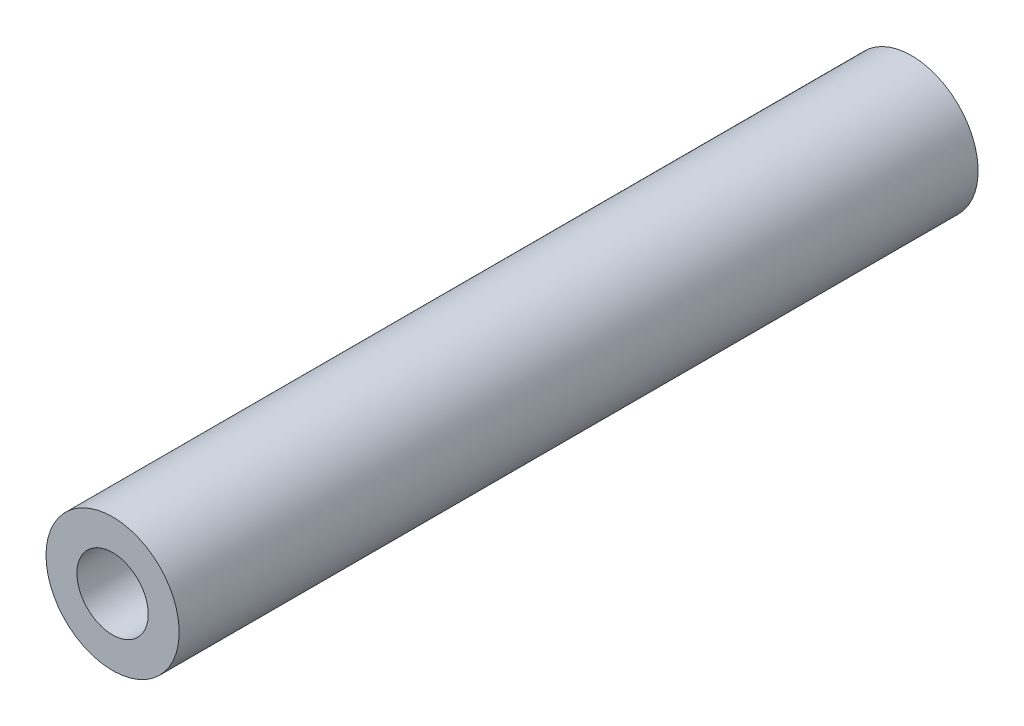
ISO-10303-21;
HEADER;
FILE_DESCRIPTION(('STEP AP214'),'2;1');
FILE_NAME('part.step','',(''),(''),'','','');
FILE_SCHEMA(('AUTOMOTIVE_DESIGN { 1 0 10303 214 1 1 1 1 }'));
ENDSEC;
DATA;
#1=APPLICATION_CONTEXT('core data for automotive mechanical design processes');
#2=APPLICATION_PROTOCOL_DEFINITION('international standard','automotive_design',2000,#1);
#3=PRODUCT_CONTEXT('',#1,'mechanical');
#4=PRODUCT('Part','Part','',(#3));
#5=PRODUCT_RELATED_PRODUCT_CATEGORY('part','',(#4));
#6=PRODUCT_DEFINITION_FORMATION('','',#4);
#7=PRODUCT_DEFINITION_CONTEXT('part definition',#1,'design');
#8=PRODUCT_DEFINITION('design','',#6,#7);
#9=PRODUCT_DEFINITION_SHAPE('','',#8);
#10=(LENGTH_UNIT() NAMED_UNIT(*) SI_UNIT(.MILLI.,.METRE.));
#11=(NAMED_UNIT(*) PLANE_ANGLE_UNIT() SI_UNIT($,.RADIAN.));
#12=(NAMED_UNIT(*) SI_UNIT($,.STERADIAN.) SOLID_ANGLE_UNIT());
#13=UNCERTAINTY_MEASURE_WITH_UNIT(LENGTH_MEASURE(1.E-05),#10,'distance_accuracy_value','');
#14=(GEOMETRIC_REPRESENTATION_CONTEXT(3) GLOBAL_UNCERTAINTY_ASSIGNED_CONTEXT((#13)) GLOBAL_UNIT_ASSIGNED_CONTEXT((#10,
#11,#12)) REPRESENTATION_CONTEXT('',''));
#15=CARTESIAN_POINT('',(0.,0.,0.));
#16=DIRECTION('',(0.,0.,1.));
#17=DIRECTION('',(1.,0.,0.));
#18=AXIS2_PLACEMENT_3D('',#15,#16,#17);
#19=CARTESIAN_POINT('',(0.,0.,28.575));
#20=DIRECTION('',(0.,0.,-1.));
#21=DIRECTION('',(-1.,0.,0.));
#22=AXIS2_PLACEMENT_3D('',#19,#20,#21);
#23=CYLINDRICAL_SURFACE('',#22,2.5527);
#24=CARTESIAN_POINT('',(0.,0.,-28.575));
#25=DIRECTION('',(0.,0.,-1.));
#26=DIRECTION('',(-1.,0.,0.));
#27=AXIS2_PLACEMENT_3D('',#24,#25,#26);
#28=CIRCLE('',#27,2.5527);
#29=CARTESIAN_POINT('',(-2.5527,0.,-28.575));
#30=VERTEX_POINT('',#29);
#31=EDGE_CURVE('E26',#30,#30,#28,.T.);
#32=ORIENTED_EDGE('',*,*,#31,.T.);
#33=EDGE_LOOP('',(#32));
#34=FACE_BOUND('',#33,.T.);
#35=CARTESIAN_POINT('',(0.,0.,28.575));
#36=DIRECTION('',(0.,0.,-1.));
#37=DIRECTION('',(-1.,0.,0.));
#38=AXIS2_PLACEMENT_3D('',#35,#36,#37);
#39=CIRCLE('',#38,2.5527);
#40=CARTESIAN_POINT('',(-2.5527,0.,28.575));
#41=VERTEX_POINT('',#40);
#42=EDGE_CURVE('E17',#41,#41,#39,.T.);
#43=ORIENTED_EDGE('',*,*,#42,.F.);
#44=EDGE_LOOP('',(#43));
#45=FACE_BOUND('',#44,.T.);
#46=ADVANCED_FACE('F14',(#34,#45),#23,.F.);
#47=CARTESIAN_POINT('',(0.,0.,28.575));
#48=DIRECTION('',(0.,0.,1.));
#49=DIRECTION('',(1.,0.,0.));
#50=AXIS2_PLACEMENT_3D('',#47,#48,#49);
#51=PLANE('',#50);
#52=ORIENTED_EDGE('',*,*,#42,.T.);
#53=EDGE_LOOP('',(#52));
#54=FACE_BOUND('',#53,.T.);
#55=CARTESIAN_POINT('',(0.,0.,28.575));
#56=DIRECTION('',(0.,0.,-1.));
#57=DIRECTION('',(-1.,0.,0.));
#58=AXIS2_PLACEMENT_3D('',#55,#56,#57);
#59=CIRCLE('',#58,4.7625);
#60=CARTESIAN_POINT('',(-4.7625,0.,28.575));
#61=VERTEX_POINT('',#60);
#62=EDGE_CURVE('E21',#61,#61,#59,.T.);
#63=ORIENTED_EDGE('',*,*,#62,.F.);
#64=EDGE_LOOP('',(#63));
#65=FACE_BOUND('',#64,.T.);
#66=ADVANCED_FACE('F34',(#54,#65),#51,.T.);
#67=CARTESIAN_POINT('',(0.,0.,-28.575));
#68=DIRECTION('',(0.,0.,1.));
#69=DIRECTION('',(1.,0.,0.));
#70=AXIS2_PLACEMENT_3D('',#67,#68,#69);
#71=PLANE('',#70);
#72=ORIENTED_EDGE('',*,*,#31,.F.);
#73=EDGE_LOOP('',(#72));
#74=FACE_BOUND('',#73,.T.);
#75=CARTESIAN_POINT('',(0.,0.,-28.575));
#76=DIRECTION('',(0.,0.,-1.));
#77=DIRECTION('',(-1.,0.,0.));
#78=AXIS2_PLACEMENT_3D('',#75,#76,#77);
#79=CIRCLE('',#78,4.7625);
#80=CARTESIAN_POINT('',(-4.7625,0.,-28.575));
#81=VERTEX_POINT('',#80);
#82=EDGE_CURVE('E10',#81,#81,#79,.F.);
#83=ORIENTED_EDGE('',*,*,#82,.F.);
#84=EDGE_LOOP('',(#83));
#85=FACE_BOUND('',#84,.T.);
#86=ADVANCED_FACE('F42',(#74,#85),#71,.F.);
#87=CARTESIAN_POINT('',(0.,0.,28.575));
#88=DIRECTION('',(0.,0.,-1.));
#89=DIRECTION('',(-1.,0.,0.));
#90=AXIS2_PLACEMENT_3D('',#87,#88,#89);
#91=CYLINDRICAL_SURFACE('',#90,4.7625);
#92=ORIENTED_EDGE('',*,*,#82,.T.);
#93=EDGE_LOOP('',(#92));
#94=FACE_BOUND('',#93,.T.);
#95=ORIENTED_EDGE('',*,*,#62,.T.);
#96=EDGE_LOOP('',(#95));
#97=FACE_BOUND('',#96,.T.);
#98=ADVANCED_FACE('F43',(#94,#97),#91,.T.);
#99=CLOSED_SHELL('',(#46,#66,#86,#98));
#100=MANIFOLD_SOLID_BREP('B1',#99);
#101=ADVANCED_BREP_SHAPE_REPRESENTATION('',(#18,#100),#14);
#102=SHAPE_DEFINITION_REPRESENTATION(#9,#101);
ENDSEC;
END-ISO-10303-21;
